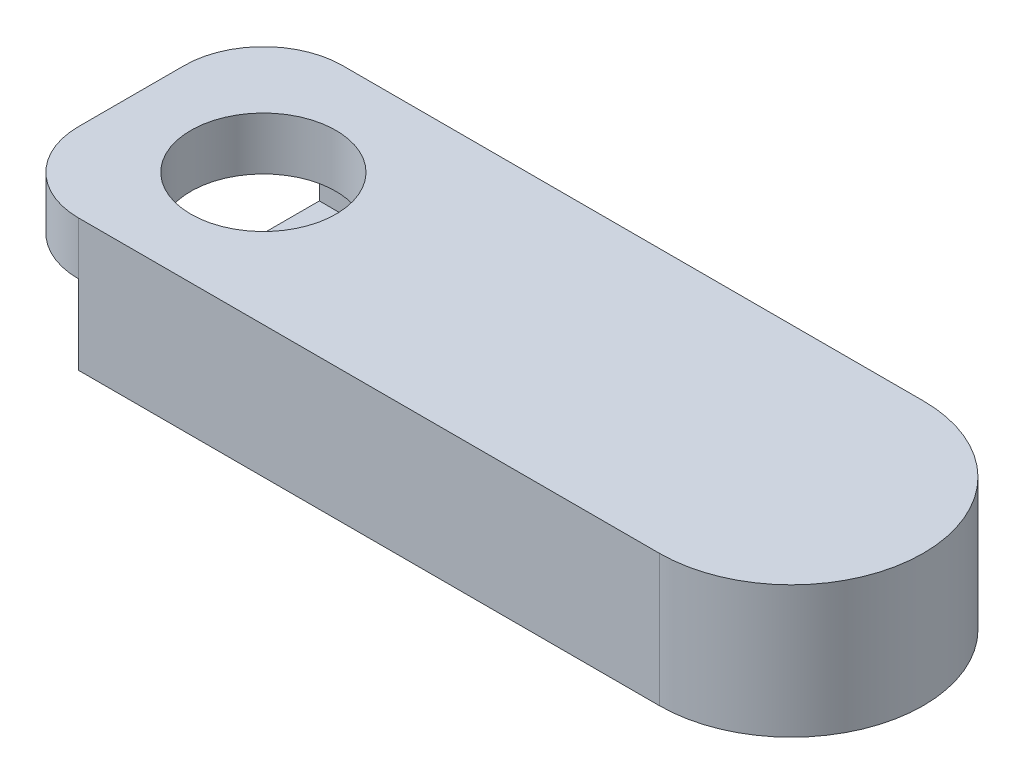
ISO-10303-21;
HEADER;
FILE_DESCRIPTION(('STEP AP214'),'2;1');
FILE_NAME('part.step','',(''),(''),'','','');
FILE_SCHEMA(('AUTOMOTIVE_DESIGN { 1 0 10303 214 1 1 1 1 }'));
ENDSEC;
DATA;
#1=APPLICATION_CONTEXT('core data for automotive mechanical design processes');
#2=APPLICATION_PROTOCOL_DEFINITION('international standard','automotive_design',2000,#1);
#3=PRODUCT_CONTEXT('',#1,'mechanical');
#4=PRODUCT('Part','Part','',(#3));
#5=PRODUCT_RELATED_PRODUCT_CATEGORY('part','',(#4));
#6=PRODUCT_DEFINITION_FORMATION('','',#4);
#7=PRODUCT_DEFINITION_CONTEXT('part definition',#1,'design');
#8=PRODUCT_DEFINITION('design','',#6,#7);
#9=PRODUCT_DEFINITION_SHAPE('','',#8);
#10=(LENGTH_UNIT() NAMED_UNIT(*) SI_UNIT(.MILLI.,.METRE.));
#11=(NAMED_UNIT(*) PLANE_ANGLE_UNIT() SI_UNIT($,.RADIAN.));
#12=(NAMED_UNIT(*) SI_UNIT($,.STERADIAN.) SOLID_ANGLE_UNIT());
#13=UNCERTAINTY_MEASURE_WITH_UNIT(LENGTH_MEASURE(1.E-05),#10,'distance_accuracy_value','');
#14=(GEOMETRIC_REPRESENTATION_CONTEXT(3) GLOBAL_UNCERTAINTY_ASSIGNED_CONTEXT((#13)) GLOBAL_UNIT_ASSIGNED_CONTEXT((#10,
#11,#12)) REPRESENTATION_CONTEXT('',''));
#15=CARTESIAN_POINT('',(0.,0.,0.));
#16=DIRECTION('',(0.,0.,1.));
#17=DIRECTION('',(1.,0.,0.));
#18=AXIS2_PLACEMENT_3D('',#15,#16,#17);
#19=CARTESIAN_POINT('',(0.,25.4,0.));
#20=DIRECTION('',(0.,0.,1.));
#21=DIRECTION('',(1.,0.,0.));
#22=AXIS2_PLACEMENT_3D('',#19,#20,#21);
#23=PLANE('',#22);
#24=DIRECTION('',(0.,-1.,0.));
#25=VECTOR('',#24,1.);
#26=CARTESIAN_POINT('',(-63.5,25.4,0.));
#27=LINE('',#26,#25);
#28=CARTESIAN_POINT('',(-63.5,25.4,0.));
#29=VERTEX_POINT('',#28);
#30=CARTESIAN_POINT('',(-63.5,-38.1,0.));
#31=VERTEX_POINT('',#30);
#32=EDGE_CURVE('E262',#29,#31,#27,.T.);
#33=ORIENTED_EDGE('',*,*,#32,.T.);
#34=DIRECTION('',(-1.,0.,0.));
#35=VECTOR('',#34,1.);
#36=CARTESIAN_POINT('',(-342.9,-38.1,0.));
#37=LINE('',#36,#35);
#38=CARTESIAN_POINT('',(-342.9,-38.1,0.));
#39=VERTEX_POINT('',#38);
#40=EDGE_CURVE('E175',#31,#39,#37,.T.);
#41=ORIENTED_EDGE('',*,*,#40,.T.);
#42=DIRECTION('',(0.,1.,0.));
#43=VECTOR('',#42,1.);
#44=CARTESIAN_POINT('',(-342.9,-25.4,0.));
#45=LINE('',#44,#43);
#46=CARTESIAN_POINT('',(-342.9,0.,0.));
#47=VERTEX_POINT('',#46);
#48=EDGE_CURVE('E248',#39,#47,#45,.T.);
#49=ORIENTED_EDGE('',*,*,#48,.T.);
#50=DIRECTION('',(0.,-1.,0.));
#51=VECTOR('',#50,1.);
#52=CARTESIAN_POINT('',(-342.9,25.4,0.));
#53=LINE('',#52,#51);
#54=CARTESIAN_POINT('',(-342.9,25.4,0.));
#55=VERTEX_POINT('',#54);
#56=EDGE_CURVE('E278',#47,#55,#53,.F.);
#57=ORIENTED_EDGE('',*,*,#56,.T.);
#58=DIRECTION('',(-1.,0.,0.));
#59=VECTOR('',#58,1.);
#60=CARTESIAN_POINT('',(0.,25.4,0.));
#61=LINE('',#60,#59);
#62=EDGE_CURVE('E254',#29,#55,#61,.T.);
#63=ORIENTED_EDGE('',*,*,#62,.F.);
#64=EDGE_LOOP('',(#33,#41,#49,#57,#63));
#65=FACE_BOUND('',#64,.T.);
#66=ADVANCED_FACE('F37',(#65),#23,.F.);
#67=CARTESIAN_POINT('',(-381.,25.4,0.));
#68=DIRECTION('',(1.,0.,0.));
#69=DIRECTION('',(0.,0.,-1.));
#70=AXIS2_PLACEMENT_3D('',#67,#68,#69);
#71=PLANE('',#70);
#72=DIRECTION('',(0.,0.,1.));
#73=VECTOR('',#72,1.);
#74=CARTESIAN_POINT('',(-381.,25.4,0.));
#75=LINE('',#74,#73);
#76=CARTESIAN_POINT('',(-381.,25.4,38.1));
#77=VERTEX_POINT('',#76);
#78=CARTESIAN_POINT('',(-381.,25.4,88.9000000000001));
#79=VERTEX_POINT('',#78);
#80=EDGE_CURVE('E257',#77,#79,#75,.T.);
#81=ORIENTED_EDGE('',*,*,#80,.F.);
#82=DIRECTION('',(0.,-1.,0.));
#83=VECTOR('',#82,1.);
#84=CARTESIAN_POINT('',(-381.,25.4,38.1));
#85=LINE('',#84,#83);
#86=CARTESIAN_POINT('',(-381.,0.,38.1));
#87=VERTEX_POINT('',#86);
#88=EDGE_CURVE('E270',#77,#87,#85,.T.);
#89=ORIENTED_EDGE('',*,*,#88,.T.);
#90=DIRECTION('',(0.,0.,1.));
#91=VECTOR('',#90,1.);
#92=CARTESIAN_POINT('',(-381.,0.,0.));
#93=LINE('',#92,#91);
#94=CARTESIAN_POINT('',(-381.,0.,88.9000000000001));
#95=VERTEX_POINT('',#94);
#96=EDGE_CURVE('E258',#87,#95,#93,.T.);
#97=ORIENTED_EDGE('',*,*,#96,.T.);
#98=DIRECTION('',(0.,-1.,0.));
#99=VECTOR('',#98,1.);
#100=CARTESIAN_POINT('',(-381.,25.4,88.9000000000001));
#101=LINE('',#100,#99);
#102=EDGE_CURVE('E163',#95,#79,#101,.F.);
#103=ORIENTED_EDGE('',*,*,#102,.T.);
#104=EDGE_LOOP('',(#81,#89,#97,#103));
#105=FACE_BOUND('',#104,.T.);
#106=ADVANCED_FACE('F289',(#105),#71,.F.);
#107=CARTESIAN_POINT('',(-381.,25.4,127.));
#108=DIRECTION('',(0.,0.,-1.));
#109=DIRECTION('',(-1.,0.,0.));
#110=AXIS2_PLACEMENT_3D('',#107,#108,#109);
#111=PLANE('',#110);
#112=DIRECTION('',(1.,0.,0.));
#113=VECTOR('',#112,1.);
#114=CARTESIAN_POINT('',(-381.,25.4,127.));
#115=LINE('',#114,#113);
#116=CARTESIAN_POINT('',(-342.9,25.4,127.));
#117=VERTEX_POINT('',#116);
#118=CARTESIAN_POINT('',(-63.5,25.4,127.));
#119=VERTEX_POINT('',#118);
#120=EDGE_CURVE('E260',#117,#119,#115,.T.);
#121=ORIENTED_EDGE('',*,*,#120,.F.);
#122=DIRECTION('',(0.,-1.,0.));
#123=VECTOR('',#122,1.);
#124=CARTESIAN_POINT('',(-342.9,25.4,127.));
#125=LINE('',#124,#123);
#126=CARTESIAN_POINT('',(-342.9,0.,127.));
#127=VERTEX_POINT('',#126);
#128=EDGE_CURVE('E11',#117,#127,#125,.T.);
#129=ORIENTED_EDGE('',*,*,#128,.T.);
#130=DIRECTION('',(0.,1.,0.));
#131=VECTOR('',#130,1.);
#132=CARTESIAN_POINT('',(-342.9,-25.4,127.));
#133=LINE('',#132,#131);
#134=CARTESIAN_POINT('',(-342.9,-38.1,127.));
#135=VERTEX_POINT('',#134);
#136=EDGE_CURVE('E178',#135,#127,#133,.T.);
#137=ORIENTED_EDGE('',*,*,#136,.F.);
#138=DIRECTION('',(1.,0.,0.));
#139=VECTOR('',#138,1.);
#140=CARTESIAN_POINT('',(-63.5,-38.1,127.));
#141=LINE('',#140,#139);
#142=CARTESIAN_POINT('',(-63.5,-38.1,127.));
#143=VERTEX_POINT('',#142);
#144=EDGE_CURVE('E171',#135,#143,#141,.T.);
#145=ORIENTED_EDGE('',*,*,#144,.T.);
#146=DIRECTION('',(0.,-1.,0.));
#147=VECTOR('',#146,1.);
#148=CARTESIAN_POINT('',(-63.5,25.4,127.));
#149=LINE('',#148,#147);
#150=EDGE_CURVE('E154',#143,#119,#149,.F.);
#151=ORIENTED_EDGE('',*,*,#150,.T.);
#152=EDGE_LOOP('',(#121,#129,#137,#145,#151));
#153=FACE_BOUND('',#152,.T.);
#154=ADVANCED_FACE('F177',(#153),#111,.F.);
#155=CARTESIAN_POINT('',(0.,25.4,0.));
#156=DIRECTION('',(0.,1.,0.));
#157=DIRECTION('',(0.,0.,1.));
#158=AXIS2_PLACEMENT_3D('',#155,#156,#157);
#159=PLANE('',#158);
#160=CARTESIAN_POINT('',(-317.5,25.4,63.5000000000001));
#161=DIRECTION('',(0.,1.,0.));
#162=DIRECTION('',(0.,0.,1.));
#163=AXIS2_PLACEMENT_3D('',#160,#161,#162);
#164=CIRCLE('',#163,34.925);
#165=CARTESIAN_POINT('',(-317.5,25.4,98.4250000000001));
#166=VERTEX_POINT('',#165);
#167=EDGE_CURVE('E184',#166,#166,#164,.T.);
#168=ORIENTED_EDGE('',*,*,#167,.F.);
#169=EDGE_LOOP('',(#168));
#170=FACE_BOUND('',#169,.T.);
#171=ORIENTED_EDGE('',*,*,#62,.T.);
#172=CARTESIAN_POINT('',(-342.9,25.4,38.1));
#173=DIRECTION('',(0.,1.,0.));
#174=DIRECTION('',(0.,0.,1.));
#175=AXIS2_PLACEMENT_3D('',#172,#173,#174);
#176=CIRCLE('',#175,38.1);
#177=EDGE_CURVE('E46',#55,#77,#176,.T.);
#178=ORIENTED_EDGE('',*,*,#177,.T.);
#179=ORIENTED_EDGE('',*,*,#80,.T.);
#180=CARTESIAN_POINT('',(-342.9,25.4,88.9000000000001));
#181=DIRECTION('',(0.,1.,0.));
#182=DIRECTION('',(0.,0.,1.));
#183=AXIS2_PLACEMENT_3D('',#180,#181,#182);
#184=CIRCLE('',#183,38.1);
#185=EDGE_CURVE('E61',#79,#117,#184,.T.);
#186=ORIENTED_EDGE('',*,*,#185,.T.);
#187=ORIENTED_EDGE('',*,*,#120,.T.);
#188=CARTESIAN_POINT('',(-63.5,25.4,63.5000000000001));
#189=DIRECTION('',(0.,1.,0.));
#190=DIRECTION('',(0.,0.,1.));
#191=AXIS2_PLACEMENT_3D('',#188,#189,#190);
#192=CIRCLE('',#191,63.5);
#193=CARTESIAN_POINT('',(0.,25.4,63.5000000000001));
#194=VERTEX_POINT('',#193);
#195=EDGE_CURVE('E160',#119,#194,#192,.T.);
#196=ORIENTED_EDGE('',*,*,#195,.T.);
#197=CARTESIAN_POINT('',(-63.5,25.4,63.5));
#198=DIRECTION('',(0.,1.,0.));
#199=DIRECTION('',(0.,0.,1.));
#200=AXIS2_PLACEMENT_3D('',#197,#198,#199);
#201=CIRCLE('',#200,63.5);
#202=EDGE_CURVE('E164',#194,#29,#201,.T.);
#203=ORIENTED_EDGE('',*,*,#202,.T.);
#204=EDGE_LOOP('',(#171,#178,#179,#186,#187,#196,#203));
#205=FACE_BOUND('',#204,.T.);
#206=ADVANCED_FACE('F283',(#170,#205),#159,.T.);
#207=CARTESIAN_POINT('',(0.,0.,0.));
#208=DIRECTION('',(0.,1.,0.));
#209=DIRECTION('',(0.,0.,1.));
#210=AXIS2_PLACEMENT_3D('',#207,#208,#209);
#211=PLANE('',#210);
#212=CARTESIAN_POINT('',(-317.5,0.,63.5000000000001));
#213=DIRECTION('',(0.,1.,0.));
#214=DIRECTION('',(0.,0.,1.));
#215=AXIS2_PLACEMENT_3D('',#212,#213,#214);
#216=CIRCLE('',#215,34.925);
#217=CARTESIAN_POINT('',(-317.5,0.,98.4250000000001));
#218=VERTEX_POINT('',#217);
#219=EDGE_CURVE('E41',#218,#218,#216,.T.);
#220=ORIENTED_EDGE('',*,*,#219,.T.);
#221=EDGE_LOOP('',(#220));
#222=FACE_BOUND('',#221,.T.);
#223=DIRECTION('',(-1.,0.,0.));
#224=VECTOR('',#223,1.);
#225=CARTESIAN_POINT('',(-342.9,0.,114.3));
#226=LINE('',#225,#224);
#227=CARTESIAN_POINT('',(-63.5,0.,114.3));
#228=VERTEX_POINT('',#227);
#229=CARTESIAN_POINT('',(-342.9,0.,114.3));
#230=VERTEX_POINT('',#229);
#231=EDGE_CURVE('E232',#228,#230,#226,.T.);
#232=ORIENTED_EDGE('',*,*,#231,.T.);
#233=DIRECTION('',(0.,0.,1.));
#234=VECTOR('',#233,1.);
#235=CARTESIAN_POINT('',(-342.9,0.,127.));
#236=LINE('',#235,#234);
#237=EDGE_CURVE('E235',#230,#127,#236,.T.);
#238=ORIENTED_EDGE('',*,*,#237,.T.);
#239=CARTESIAN_POINT('',(-342.9,0.,88.9000000000001));
#240=DIRECTION('',(0.,1.,0.));
#241=DIRECTION('',(0.,0.,1.));
#242=AXIS2_PLACEMENT_3D('',#239,#240,#241);
#243=CIRCLE('',#242,38.1);
#244=EDGE_CURVE('E273',#127,#95,#243,.F.);
#245=ORIENTED_EDGE('',*,*,#244,.T.);
#246=ORIENTED_EDGE('',*,*,#96,.F.);
#247=CARTESIAN_POINT('',(-342.9,0.,38.1));
#248=DIRECTION('',(0.,1.,0.));
#249=DIRECTION('',(0.,0.,1.));
#250=AXIS2_PLACEMENT_3D('',#247,#248,#249);
#251=CIRCLE('',#250,38.1);
#252=EDGE_CURVE('E275',#87,#47,#251,.F.);
#253=ORIENTED_EDGE('',*,*,#252,.T.);
#254=DIRECTION('',(0.,0.,1.));
#255=VECTOR('',#254,1.);
#256=CARTESIAN_POINT('',(-342.9,0.,11.1592316367926));
#257=LINE('',#256,#255);
#258=CARTESIAN_POINT('',(-342.9,0.,11.1592316367926));
#259=VERTEX_POINT('',#258);
#260=EDGE_CURVE('E238',#47,#259,#257,.T.);
#261=ORIENTED_EDGE('',*,*,#260,.T.);
#262=DIRECTION('',(0.999984795154886,0.,0.00551447722284597));
#263=VECTOR('',#262,1.);
#264=CARTESIAN_POINT('',(-63.5,0.,12.7000000000001));
#265=LINE('',#264,#263);
#266=CARTESIAN_POINT('',(-63.5,0.,12.7000000000001));
#267=VERTEX_POINT('',#266);
#268=EDGE_CURVE('E224',#259,#267,#265,.T.);
#269=ORIENTED_EDGE('',*,*,#268,.T.);
#270=CARTESIAN_POINT('',(-63.5,0.,63.5000000000001));
#271=DIRECTION('',(0.,-1.,0.));
#272=DIRECTION('',(0.,0.,1.));
#273=AXIS2_PLACEMENT_3D('',#270,#271,#272);
#274=CIRCLE('',#273,50.8);
#275=EDGE_CURVE('E53',#267,#228,#274,.T.);
#276=ORIENTED_EDGE('',*,*,#275,.T.);
#277=EDGE_LOOP('',(#232,#238,#245,#246,#253,#261,#269,#276));
#278=FACE_BOUND('',#277,.T.);
#279=ADVANCED_FACE('F294',(#222,#278),#211,.F.);
#280=CARTESIAN_POINT('',(-63.5,25.4,63.5000000000001));
#281=DIRECTION('',(0.,-1.,0.));
#282=DIRECTION('',(0.,0.,-1.));
#283=AXIS2_PLACEMENT_3D('',#280,#281,#282);
#284=CYLINDRICAL_SURFACE('',#283,63.5);
#285=DIRECTION('',(0.,-1.,0.));
#286=VECTOR('',#285,1.);
#287=CARTESIAN_POINT('',(0.,25.4,63.5000000000001));
#288=LINE('',#287,#286);
#289=CARTESIAN_POINT('',(0.,0.,63.5000000000001));
#290=VERTEX_POINT('',#289);
#291=EDGE_CURVE('E245',#194,#290,#288,.T.);
#292=ORIENTED_EDGE('',*,*,#291,.F.);
#293=ORIENTED_EDGE('',*,*,#195,.F.);
#294=ORIENTED_EDGE('',*,*,#150,.F.);
#295=CARTESIAN_POINT('',(-63.5,-38.1,63.5000000000001));
#296=DIRECTION('',(0.,1.,0.));
#297=DIRECTION('',(0.,0.,1.));
#298=AXIS2_PLACEMENT_3D('',#295,#296,#297);
#299=CIRCLE('',#298,63.5);
#300=EDGE_CURVE('E159',#143,#31,#299,.T.);
#301=ORIENTED_EDGE('',*,*,#300,.T.);
#302=ORIENTED_EDGE('',*,*,#32,.F.);
#303=ORIENTED_EDGE('',*,*,#202,.F.);
#304=ORIENTED_EDGE('',*,*,#291,.T.);
#305=EDGE_LOOP('',(#292,#293,#294,#301,#302,#303,#304));
#306=FACE_BOUND('',#305,.T.);
#307=ADVANCED_FACE('F157',(#306),#284,.T.);
#308=CARTESIAN_POINT('',(-342.9,25.4,38.1));
#309=DIRECTION('',(0.,-1.,0.));
#310=DIRECTION('',(0.,0.,-1.));
#311=AXIS2_PLACEMENT_3D('',#308,#309,#310);
#312=CYLINDRICAL_SURFACE('',#311,38.1);
#313=ORIENTED_EDGE('',*,*,#177,.F.);
#314=ORIENTED_EDGE('',*,*,#56,.F.);
#315=ORIENTED_EDGE('',*,*,#252,.F.);
#316=ORIENTED_EDGE('',*,*,#88,.F.);
#317=EDGE_LOOP('',(#313,#314,#315,#316));
#318=FACE_BOUND('',#317,.T.);
#319=ADVANCED_FACE('F292',(#318),#312,.T.);
#320=CARTESIAN_POINT('',(-342.9,25.4,88.9000000000001));
#321=DIRECTION('',(0.,-1.,0.));
#322=DIRECTION('',(0.,0.,-1.));
#323=AXIS2_PLACEMENT_3D('',#320,#321,#322);
#324=CYLINDRICAL_SURFACE('',#323,38.1);
#325=ORIENTED_EDGE('',*,*,#185,.F.);
#326=ORIENTED_EDGE('',*,*,#102,.F.);
#327=ORIENTED_EDGE('',*,*,#244,.F.);
#328=ORIENTED_EDGE('',*,*,#128,.F.);
#329=EDGE_LOOP('',(#325,#326,#327,#328));
#330=FACE_BOUND('',#329,.T.);
#331=ADVANCED_FACE('F39',(#330),#324,.T.);
#332=CARTESIAN_POINT('',(-63.5,-25.4,63.5000000000001));
#333=DIRECTION('',(0.,1.,0.));
#334=DIRECTION('',(0.,0.,1.));
#335=AXIS2_PLACEMENT_3D('',#332,#333,#334);
#336=CYLINDRICAL_SURFACE('',#335,50.8);
#337=ORIENTED_EDGE('',*,*,#275,.F.);
#338=DIRECTION('',(0.,1.,0.));
#339=VECTOR('',#338,1.);
#340=CARTESIAN_POINT('',(-63.5,-25.4,12.7000000000001));
#341=LINE('',#340,#339);
#342=CARTESIAN_POINT('',(-63.5,-25.4,12.7000000000001));
#343=VERTEX_POINT('',#342);
#344=EDGE_CURVE('E243',#343,#267,#341,.T.);
#345=ORIENTED_EDGE('',*,*,#344,.F.);
#346=CARTESIAN_POINT('',(-63.5,-25.4,63.5000000000001));
#347=DIRECTION('',(0.,-1.,0.));
#348=DIRECTION('',(0.,0.,1.));
#349=AXIS2_PLACEMENT_3D('',#346,#347,#348);
#350=CIRCLE('',#349,50.8);
#351=CARTESIAN_POINT('',(-63.5,-25.4,114.3));
#352=VERTEX_POINT('',#351);
#353=EDGE_CURVE('E220',#343,#352,#350,.T.);
#354=ORIENTED_EDGE('',*,*,#353,.T.);
#355=DIRECTION('',(0.,1.,0.));
#356=VECTOR('',#355,1.);
#357=CARTESIAN_POINT('',(-63.5,-25.4,114.3));
#358=LINE('',#357,#356);
#359=EDGE_CURVE('E230',#352,#228,#358,.T.);
#360=ORIENTED_EDGE('',*,*,#359,.T.);
#361=EDGE_LOOP('',(#337,#345,#354,#360));
#362=FACE_BOUND('',#361,.T.);
#363=ADVANCED_FACE('F330',(#362),#336,.F.);
#364=CARTESIAN_POINT('',(-63.5,-25.4,12.7000000000001));
#365=DIRECTION('',(-0.00551447722284597,0.,0.999984795154886));
#366=DIRECTION('',(0.999984795154886,0.,0.00551447722284597));
#367=AXIS2_PLACEMENT_3D('',#364,#365,#366);
#368=PLANE('',#367);
#369=ORIENTED_EDGE('',*,*,#268,.F.);
#370=DIRECTION('',(0.,1.,0.));
#371=VECTOR('',#370,1.);
#372=CARTESIAN_POINT('',(-342.9,-25.4,11.1592316367926));
#373=LINE('',#372,#371);
#374=CARTESIAN_POINT('',(-342.9,-25.4,11.1592316367926));
#375=VERTEX_POINT('',#374);
#376=EDGE_CURVE('E246',#375,#259,#373,.T.);
#377=ORIENTED_EDGE('',*,*,#376,.F.);
#378=DIRECTION('',(0.999984795154886,0.,0.00551447722284597));
#379=VECTOR('',#378,1.);
#380=CARTESIAN_POINT('',(-63.5,-25.4,12.7000000000001));
#381=LINE('',#380,#379);
#382=EDGE_CURVE('E227',#375,#343,#381,.T.);
#383=ORIENTED_EDGE('',*,*,#382,.T.);
#384=ORIENTED_EDGE('',*,*,#344,.T.);
#385=EDGE_LOOP('',(#369,#377,#383,#384));
#386=FACE_BOUND('',#385,.T.);
#387=ADVANCED_FACE('F307',(#386),#368,.T.);
#388=CARTESIAN_POINT('',(-342.9,-25.4,11.1592316367926));
#389=DIRECTION('',(-1.,0.,0.));
#390=DIRECTION('',(0.,0.,1.));
#391=AXIS2_PLACEMENT_3D('',#388,#389,#390);
#392=PLANE('',#391);
#393=ORIENTED_EDGE('',*,*,#260,.F.);
#394=ORIENTED_EDGE('',*,*,#48,.F.);
#395=DIRECTION('',(0.,0.,1.));
#396=VECTOR('',#395,1.);
#397=CARTESIAN_POINT('',(-342.9,-38.1,0.));
#398=LINE('',#397,#396);
#399=CARTESIAN_POINT('',(-342.9,-38.1,44.45));
#400=VERTEX_POINT('',#399);
#401=EDGE_CURVE('E187',#39,#400,#398,.T.);
#402=ORIENTED_EDGE('',*,*,#401,.T.);
#403=DIRECTION('',(0.,1.,0.));
#404=VECTOR('',#403,1.);
#405=CARTESIAN_POINT('',(-342.9,-38.1,44.45));
#406=LINE('',#405,#404);
#407=CARTESIAN_POINT('',(-342.9,-25.4,44.45));
#408=VERTEX_POINT('',#407);
#409=EDGE_CURVE('E201',#400,#408,#406,.T.);
#410=ORIENTED_EDGE('',*,*,#409,.T.);
#411=DIRECTION('',(0.,0.,1.));
#412=VECTOR('',#411,1.);
#413=CARTESIAN_POINT('',(-342.9,-25.4,0.));
#414=LINE('',#413,#412);
#415=EDGE_CURVE('E202',#375,#408,#414,.T.);
#416=ORIENTED_EDGE('',*,*,#415,.F.);
#417=ORIENTED_EDGE('',*,*,#376,.T.);
#418=EDGE_LOOP('',(#393,#394,#402,#410,#416,#417));
#419=FACE_BOUND('',#418,.T.);
#420=ADVANCED_FACE('F302',(#419),#392,.T.);
#421=CARTESIAN_POINT('',(-342.9,-25.4,127.));
#422=DIRECTION('',(-1.,0.,0.));
#423=DIRECTION('',(0.,0.,1.));
#424=AXIS2_PLACEMENT_3D('',#421,#422,#423);
#425=PLANE('',#424);
#426=ORIENTED_EDGE('',*,*,#237,.F.);
#427=DIRECTION('',(0.,1.,0.));
#428=VECTOR('',#427,1.);
#429=CARTESIAN_POINT('',(-342.9,-25.4,114.3));
#430=LINE('',#429,#428);
#431=CARTESIAN_POINT('',(-342.9,-25.4,114.3));
#432=VERTEX_POINT('',#431);
#433=EDGE_CURVE('E251',#432,#230,#430,.T.);
#434=ORIENTED_EDGE('',*,*,#433,.F.);
#435=DIRECTION('',(0.,0.,1.));
#436=VECTOR('',#435,1.);
#437=CARTESIAN_POINT('',(-342.9,-25.4,127.));
#438=LINE('',#437,#436);
#439=CARTESIAN_POINT('',(-342.9,-25.4,82.5500000000001));
#440=VERTEX_POINT('',#439);
#441=EDGE_CURVE('E179',#440,#432,#438,.T.);
#442=ORIENTED_EDGE('',*,*,#441,.F.);
#443=DIRECTION('',(0.,1.,0.));
#444=VECTOR('',#443,1.);
#445=CARTESIAN_POINT('',(-342.9,-38.1,82.5500000000001));
#446=LINE('',#445,#444);
#447=CARTESIAN_POINT('',(-342.9,-38.1,82.5500000000001));
#448=VERTEX_POINT('',#447);
#449=EDGE_CURVE('E212',#448,#440,#446,.T.);
#450=ORIENTED_EDGE('',*,*,#449,.F.);
#451=DIRECTION('',(0.,0.,1.));
#452=VECTOR('',#451,1.);
#453=CARTESIAN_POINT('',(-342.9,-38.1,127.));
#454=LINE('',#453,#452);
#455=EDGE_CURVE('E199',#448,#135,#454,.T.);
#456=ORIENTED_EDGE('',*,*,#455,.T.);
#457=ORIENTED_EDGE('',*,*,#136,.T.);
#458=EDGE_LOOP('',(#426,#434,#442,#450,#456,#457));
#459=FACE_BOUND('',#458,.T.);
#460=ADVANCED_FACE('F316',(#459),#425,.T.);
#461=CARTESIAN_POINT('',(-342.9,-25.4,114.3));
#462=DIRECTION('',(0.,0.,-1.));
#463=DIRECTION('',(-1.,0.,0.));
#464=AXIS2_PLACEMENT_3D('',#461,#462,#463);
#465=PLANE('',#464);
#466=ORIENTED_EDGE('',*,*,#231,.F.);
#467=ORIENTED_EDGE('',*,*,#359,.F.);
#468=DIRECTION('',(-1.,0.,0.));
#469=VECTOR('',#468,1.);
#470=CARTESIAN_POINT('',(-342.9,-25.4,114.3));
#471=LINE('',#470,#469);
#472=EDGE_CURVE('E223',#352,#432,#471,.T.);
#473=ORIENTED_EDGE('',*,*,#472,.T.);
#474=ORIENTED_EDGE('',*,*,#433,.T.);
#475=EDGE_LOOP('',(#466,#467,#473,#474));
#476=FACE_BOUND('',#475,.T.);
#477=ADVANCED_FACE('F312',(#476),#465,.T.);
#478=CARTESIAN_POINT('',(-63.5,-25.4,63.5000000000001));
#479=DIRECTION('',(0.,1.,0.));
#480=DIRECTION('',(0.,0.,1.));
#481=AXIS2_PLACEMENT_3D('',#478,#479,#480);
#482=PLANE('',#481);
#483=ORIENTED_EDGE('',*,*,#382,.F.);
#484=ORIENTED_EDGE('',*,*,#415,.T.);
#485=DIRECTION('',(1.,0.,0.));
#486=VECTOR('',#485,1.);
#487=CARTESIAN_POINT('',(-63.5,-25.4,44.45));
#488=LINE('',#487,#486);
#489=CARTESIAN_POINT('',(-63.5,-25.4,44.45));
#490=VERTEX_POINT('',#489);
#491=EDGE_CURVE('E204',#408,#490,#488,.T.);
#492=ORIENTED_EDGE('',*,*,#491,.T.);
#493=CARTESIAN_POINT('',(-63.5,-25.4,63.5000000000001));
#494=DIRECTION('',(0.,-1.,0.));
#495=DIRECTION('',(0.,0.,1.));
#496=AXIS2_PLACEMENT_3D('',#493,#494,#495);
#497=CIRCLE('',#496,19.05);
#498=CARTESIAN_POINT('',(-63.5,-25.4,82.5500000000001));
#499=VERTEX_POINT('',#498);
#500=EDGE_CURVE('E207',#490,#499,#497,.T.);
#501=ORIENTED_EDGE('',*,*,#500,.T.);
#502=DIRECTION('',(-1.,0.,0.));
#503=VECTOR('',#502,1.);
#504=CARTESIAN_POINT('',(-342.9,-25.4,82.5500000000001));
#505=LINE('',#504,#503);
#506=EDGE_CURVE('E181',#499,#440,#505,.T.);
#507=ORIENTED_EDGE('',*,*,#506,.T.);
#508=ORIENTED_EDGE('',*,*,#441,.T.);
#509=ORIENTED_EDGE('',*,*,#472,.F.);
#510=ORIENTED_EDGE('',*,*,#353,.F.);
#511=EDGE_LOOP('',(#483,#484,#492,#501,#507,#508,#509,#510));
#512=FACE_BOUND('',#511,.T.);
#513=ADVANCED_FACE('F329',(#512),#482,.T.);
#514=CARTESIAN_POINT('',(-342.9,-38.1,82.5500000000001));
#515=DIRECTION('',(0.,0.,-1.));
#516=DIRECTION('',(-1.,0.,0.));
#517=AXIS2_PLACEMENT_3D('',#514,#515,#516);
#518=PLANE('',#517);
#519=ORIENTED_EDGE('',*,*,#506,.F.);
#520=DIRECTION('',(0.,1.,0.));
#521=VECTOR('',#520,1.);
#522=CARTESIAN_POINT('',(-63.5,-38.1,82.5500000000001));
#523=LINE('',#522,#521);
#524=CARTESIAN_POINT('',(-63.5,-38.1,82.5500000000001));
#525=VERTEX_POINT('',#524);
#526=EDGE_CURVE('E214',#525,#499,#523,.T.);
#527=ORIENTED_EDGE('',*,*,#526,.F.);
#528=DIRECTION('',(-1.,0.,0.));
#529=VECTOR('',#528,1.);
#530=CARTESIAN_POINT('',(-342.9,-38.1,82.5500000000001));
#531=LINE('',#530,#529);
#532=EDGE_CURVE('E196',#525,#448,#531,.T.);
#533=ORIENTED_EDGE('',*,*,#532,.T.);
#534=ORIENTED_EDGE('',*,*,#449,.T.);
#535=EDGE_LOOP('',(#519,#527,#533,#534));
#536=FACE_BOUND('',#535,.T.);
#537=ADVANCED_FACE('F424',(#536),#518,.T.);
#538=CARTESIAN_POINT('',(-63.5,-38.1,63.5000000000001));
#539=DIRECTION('',(0.,1.,0.));
#540=DIRECTION('',(0.,0.,1.));
#541=AXIS2_PLACEMENT_3D('',#538,#539,#540);
#542=CYLINDRICAL_SURFACE('',#541,19.05);
#543=ORIENTED_EDGE('',*,*,#500,.F.);
#544=DIRECTION('',(0.,1.,0.));
#545=VECTOR('',#544,1.);
#546=CARTESIAN_POINT('',(-63.5,-38.1,44.45));
#547=LINE('',#546,#545);
#548=CARTESIAN_POINT('',(-63.5,-38.1,44.45));
#549=VERTEX_POINT('',#548);
#550=EDGE_CURVE('E216',#549,#490,#547,.T.);
#551=ORIENTED_EDGE('',*,*,#550,.F.);
#552=CARTESIAN_POINT('',(-63.5,-38.1,63.5000000000001));
#553=DIRECTION('',(0.,-1.,0.));
#554=DIRECTION('',(0.,0.,1.));
#555=AXIS2_PLACEMENT_3D('',#552,#553,#554);
#556=CIRCLE('',#555,19.05);
#557=EDGE_CURVE('E193',#549,#525,#556,.T.);
#558=ORIENTED_EDGE('',*,*,#557,.T.);
#559=ORIENTED_EDGE('',*,*,#526,.T.);
#560=EDGE_LOOP('',(#543,#551,#558,#559));
#561=FACE_BOUND('',#560,.T.);
#562=ADVANCED_FACE('F323',(#561),#542,.F.);
#563=CARTESIAN_POINT('',(-63.5,-38.1,44.45));
#564=DIRECTION('',(0.,0.,1.));
#565=DIRECTION('',(1.,0.,0.));
#566=AXIS2_PLACEMENT_3D('',#563,#564,#565);
#567=PLANE('',#566);
#568=ORIENTED_EDGE('',*,*,#491,.F.);
#569=ORIENTED_EDGE('',*,*,#409,.F.);
#570=DIRECTION('',(1.,0.,0.));
#571=VECTOR('',#570,1.);
#572=CARTESIAN_POINT('',(-63.5,-38.1,44.45));
#573=LINE('',#572,#571);
#574=EDGE_CURVE('E190',#400,#549,#573,.T.);
#575=ORIENTED_EDGE('',*,*,#574,.T.);
#576=ORIENTED_EDGE('',*,*,#550,.T.);
#577=EDGE_LOOP('',(#568,#569,#575,#576));
#578=FACE_BOUND('',#577,.T.);
#579=ADVANCED_FACE('F327',(#578),#567,.T.);
#580=CARTESIAN_POINT('',(-63.5,-38.1,63.5000000000001));
#581=DIRECTION('',(0.,1.,0.));
#582=DIRECTION('',(0.,0.,1.));
#583=AXIS2_PLACEMENT_3D('',#580,#581,#582);
#584=PLANE('',#583);
#585=ORIENTED_EDGE('',*,*,#144,.F.);
#586=ORIENTED_EDGE('',*,*,#455,.F.);
#587=ORIENTED_EDGE('',*,*,#532,.F.);
#588=ORIENTED_EDGE('',*,*,#557,.F.);
#589=ORIENTED_EDGE('',*,*,#574,.F.);
#590=ORIENTED_EDGE('',*,*,#401,.F.);
#591=ORIENTED_EDGE('',*,*,#40,.F.);
#592=ORIENTED_EDGE('',*,*,#300,.F.);
#593=EDGE_LOOP('',(#585,#586,#587,#588,#589,#590,#591,#592));
#594=FACE_BOUND('',#593,.T.);
#595=ADVANCED_FACE('F169',(#594),#584,.F.);
#596=CARTESIAN_POINT('',(-317.5,-12.7,63.5000000000001));
#597=DIRECTION('',(0.,1.,0.));
#598=DIRECTION('',(0.,0.,1.));
#599=AXIS2_PLACEMENT_3D('',#596,#597,#598);
#600=CYLINDRICAL_SURFACE('',#599,34.925);
#601=CARTESIAN_POINT('',(-317.5,25.4,98.4250000000001));
#602=CARTESIAN_POINT('',(-317.5,25.1354166666667,98.4250000000001));
#603=CARTESIAN_POINT('',(-317.5,24.8708333333333,98.4250000000001));
#604=CARTESIAN_POINT('',(-317.5,24.3416666666667,98.4250000000001));
#605=CARTESIAN_POINT('',(-317.5,24.0770833333333,98.4250000000001));
#606=CARTESIAN_POINT('',(-317.5,23.5479166666667,98.4250000000001));
#607=CARTESIAN_POINT('',(-317.5,23.2833333333333,98.4250000000001));
#608=CARTESIAN_POINT('',(-317.5,22.7541666666667,98.4250000000001));
#609=CARTESIAN_POINT('',(-317.5,22.4895833333333,98.4250000000001));
#610=CARTESIAN_POINT('',(-317.5,21.9604166666667,98.4250000000001));
#611=CARTESIAN_POINT('',(-317.5,21.6958333333333,98.4250000000001));
#612=CARTESIAN_POINT('',(-317.5,21.1666666666667,98.4250000000001));
#613=CARTESIAN_POINT('',(-317.5,20.9020833333333,98.4250000000001));
#614=CARTESIAN_POINT('',(-317.5,20.3729166666667,98.4250000000001));
#615=CARTESIAN_POINT('',(-317.5,20.1083333333333,98.4250000000001));
#616=CARTESIAN_POINT('',(-317.5,19.5791666666667,98.4250000000001));
#617=CARTESIAN_POINT('',(-317.5,19.3145833333333,98.4250000000001));
#618=CARTESIAN_POINT('',(-317.5,18.7854166666667,98.4250000000001));
#619=CARTESIAN_POINT('',(-317.5,18.5208333333333,98.4250000000001));
#620=CARTESIAN_POINT('',(-317.5,17.9916666666667,98.4250000000001));
#621=CARTESIAN_POINT('',(-317.5,17.7270833333333,98.4250000000001));
#622=CARTESIAN_POINT('',(-317.5,17.1979166666667,98.4250000000001));
#623=CARTESIAN_POINT('',(-317.5,16.9333333333333,98.4250000000001));
#624=CARTESIAN_POINT('',(-317.5,16.4041666666667,98.4250000000001));
#625=CARTESIAN_POINT('',(-317.5,16.1395833333333,98.4250000000001));
#626=CARTESIAN_POINT('',(-317.5,15.6104166666667,98.4250000000001));
#627=CARTESIAN_POINT('',(-317.5,15.3458333333333,98.4250000000001));
#628=CARTESIAN_POINT('',(-317.5,14.8166666666667,98.4250000000001));
#629=CARTESIAN_POINT('',(-317.5,14.5520833333333,98.4250000000001));
#630=CARTESIAN_POINT('',(-317.5,14.0229166666667,98.4250000000001));
#631=CARTESIAN_POINT('',(-317.5,13.7583333333333,98.4250000000001));
#632=CARTESIAN_POINT('',(-317.5,13.2291666666667,98.4250000000001));
#633=CARTESIAN_POINT('',(-317.5,12.9645833333333,98.4250000000001));
#634=CARTESIAN_POINT('',(-317.5,12.4354166666667,98.4250000000001));
#635=CARTESIAN_POINT('',(-317.5,12.1708333333333,98.4250000000001));
#636=CARTESIAN_POINT('',(-317.5,11.6416666666667,98.4250000000001));
#637=CARTESIAN_POINT('',(-317.5,11.3770833333333,98.4250000000001));
#638=CARTESIAN_POINT('',(-317.5,10.8479166666667,98.4250000000001));
#639=CARTESIAN_POINT('',(-317.5,10.5833333333333,98.4250000000001));
#640=CARTESIAN_POINT('',(-317.5,10.0541666666667,98.4250000000001));
#641=CARTESIAN_POINT('',(-317.5,9.78958333333333,98.4250000000001));
#642=CARTESIAN_POINT('',(-317.5,9.26041666666666,98.4250000000001));
#643=CARTESIAN_POINT('',(-317.5,8.99583333333333,98.4250000000001));
#644=CARTESIAN_POINT('',(-317.5,8.46666666666667,98.4250000000001));
#645=CARTESIAN_POINT('',(-317.5,8.20208333333333,98.4250000000001));
#646=CARTESIAN_POINT('',(-317.5,7.67291666666666,98.4250000000001));
#647=CARTESIAN_POINT('',(-317.5,7.40833333333333,98.4250000000001));
#648=CARTESIAN_POINT('',(-317.5,6.87916666666666,98.4250000000001));
#649=CARTESIAN_POINT('',(-317.5,6.61458333333333,98.4250000000001));
#650=CARTESIAN_POINT('',(-317.5,6.08541666666667,98.4250000000001));
#651=CARTESIAN_POINT('',(-317.5,5.82083333333333,98.4250000000001));
#652=CARTESIAN_POINT('',(-317.5,5.29166666666667,98.4250000000001));
#653=CARTESIAN_POINT('',(-317.5,5.02708333333333,98.4250000000001));
#654=CARTESIAN_POINT('',(-317.5,4.49791666666667,98.4250000000001));
#655=CARTESIAN_POINT('',(-317.5,4.23333333333333,98.4250000000001));
#656=CARTESIAN_POINT('',(-317.5,3.70416666666666,98.4250000000001));
#657=CARTESIAN_POINT('',(-317.5,3.43958333333333,98.4250000000001));
#658=CARTESIAN_POINT('',(-317.5,2.91041666666667,98.4250000000001));
#659=CARTESIAN_POINT('',(-317.5,2.64583333333333,98.4250000000001));
#660=CARTESIAN_POINT('',(-317.5,2.11666666666667,98.4250000000001));
#661=CARTESIAN_POINT('',(-317.5,1.85208333333333,98.4250000000001));
#662=CARTESIAN_POINT('',(-317.5,1.32291666666666,98.4250000000001));
#663=CARTESIAN_POINT('',(-317.5,1.05833333333333,98.4250000000001));
#664=CARTESIAN_POINT('',(-317.5,0.529166666666665,98.4250000000001));
#665=CARTESIAN_POINT('',(-317.5,0.264583333333332,98.4250000000001));
#666=CARTESIAN_POINT('',(-317.5,0.,98.4250000000001));
#667=B_SPLINE_CURVE_WITH_KNOTS('',3,(#601,#602,#603,#604,#605,#606,#607,#608,#609,#610,#611,
#612,#613,#614,#615,#616,#617,#618,#619,#620,#621,#622,#623,#624,#625,#626,#627,#628,#629,#630,
#631,#632,#633,#634,#635,#636,#637,#638,#639,#640,#641,#642,#643,#644,#645,#646,#647,#648,#649,
#650,#651,#652,#653,#654,#655,#656,#657,#658,#659,#660,#661,#662,#663,#664,#665,#666),
.UNSPECIFIED.,.F.,.F.,(4,2,2,2,2,2,2,2,2,2,2,2,2,2,2,2,2,2,2,2,2,2,2,2,2,2,2,2,2,2,2,2,4),(0.,
0.793750000000003,1.5875,2.38125,3.175,3.96875,4.7625,5.55625,6.35,7.14375,7.9375,8.73125,9.525,
10.31875,11.1125,11.90625,12.7,13.49375,14.2875,15.08125,15.875,16.66875,17.4625,18.25625,19.05,
19.84375,20.6375,21.43125,22.225,23.01875,23.8125,24.60625,25.4),.UNSPECIFIED.);
#668=EDGE_CURVE('BSEAM457',#166,#218,#667,.T.);
#669=ORIENTED_EDGE('',*,*,#167,.T.);
#670=ORIENTED_EDGE('',*,*,#219,.F.);
#671=ORIENTED_EDGE('',*,*,#668,.T.);
#672=ORIENTED_EDGE('',*,*,#668,.F.);
#673=EDGE_LOOP('',(#669,#671,#670,#672));
#674=FACE_BOUND('',#673,.T.);
#675=ADVANCED_FACE('F457',(#674),#600,.F.);
#676=CLOSED_SHELL('',(#66,#106,#154,#206,#279,#307,#319,#331,#363,#387,#420,#460,#477,#513,#537,
#562,#579,#595,#675));
#677=MANIFOLD_SOLID_BREP('B2',#676);
#678=ADVANCED_BREP_SHAPE_REPRESENTATION('',(#18,#677),#14);
#679=SHAPE_DEFINITION_REPRESENTATION(#9,#678);
ENDSEC;
END-ISO-10303-21;
